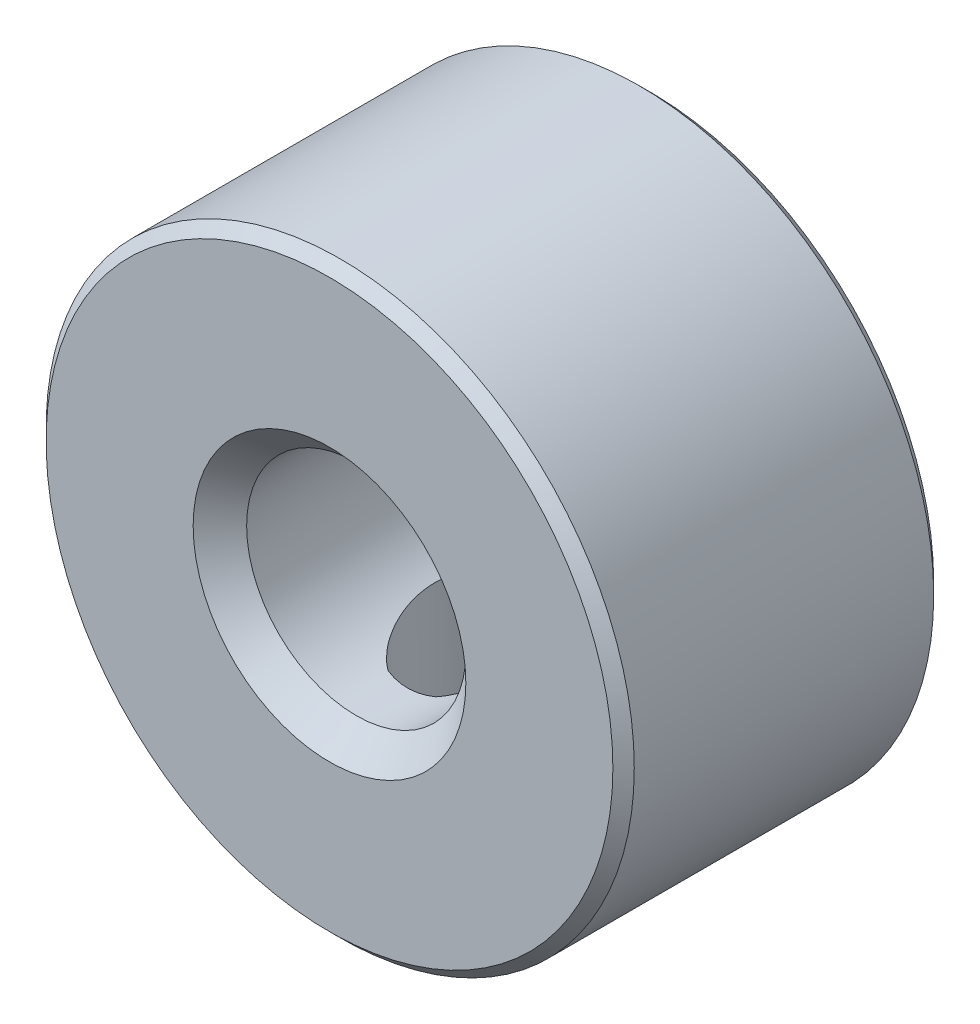
ISO-10303-21;
HEADER;
FILE_DESCRIPTION(('STEP AP214'),'2;1');
FILE_NAME('part.step','',(''),(''),'','','');
FILE_SCHEMA(('AUTOMOTIVE_DESIGN { 1 0 10303 214 1 1 1 1 }'));
ENDSEC;
DATA;
#1=APPLICATION_CONTEXT('core data for automotive mechanical design processes');
#2=APPLICATION_PROTOCOL_DEFINITION('international standard','automotive_design',2000,#1);
#3=PRODUCT_CONTEXT('',#1,'mechanical');
#4=PRODUCT('Part','Part','',(#3));
#5=PRODUCT_RELATED_PRODUCT_CATEGORY('part','',(#4));
#6=PRODUCT_DEFINITION_FORMATION('','',#4);
#7=PRODUCT_DEFINITION_CONTEXT('part definition',#1,'design');
#8=PRODUCT_DEFINITION('design','',#6,#7);
#9=PRODUCT_DEFINITION_SHAPE('','',#8);
#10=(LENGTH_UNIT() NAMED_UNIT(*) SI_UNIT(.MILLI.,.METRE.));
#11=(NAMED_UNIT(*) PLANE_ANGLE_UNIT() SI_UNIT($,.RADIAN.));
#12=(NAMED_UNIT(*) SI_UNIT($,.STERADIAN.) SOLID_ANGLE_UNIT());
#13=UNCERTAINTY_MEASURE_WITH_UNIT(LENGTH_MEASURE(1.E-05),#10,'distance_accuracy_value','');
#14=(GEOMETRIC_REPRESENTATION_CONTEXT(3) GLOBAL_UNCERTAINTY_ASSIGNED_CONTEXT((#13)) GLOBAL_UNIT_ASSIGNED_CONTEXT((#10,
#11,#12)) REPRESENTATION_CONTEXT('',''));
#15=CARTESIAN_POINT('',(0.,0.,0.));
#16=DIRECTION('',(0.,0.,1.));
#17=DIRECTION('',(1.,0.,0.));
#18=AXIS2_PLACEMENT_3D('',#15,#16,#17);
#19=CARTESIAN_POINT('',(0.,0.,6.));
#20=DIRECTION('',(0.,0.,1.));
#21=DIRECTION('',(1.,0.,0.));
#22=AXIS2_PLACEMENT_3D('',#19,#20,#21);
#23=PLANE('',#22);
#24=CARTESIAN_POINT('',(0.,0.,6.));
#25=DIRECTION('',(0.,0.,1.));
#26=DIRECTION('',(1.,0.,0.));
#27=AXIS2_PLACEMENT_3D('',#24,#25,#26);
#28=CIRCLE('',#27,5.3);
#29=CARTESIAN_POINT('',(5.3,0.,6.));
#30=VERTEX_POINT('',#29);
#31=EDGE_CURVE('E11',#30,#30,#28,.T.);
#32=ORIENTED_EDGE('',*,*,#31,.T.);
#33=EDGE_LOOP('',(#32));
#34=FACE_BOUND('',#33,.T.);
#35=CARTESIAN_POINT('',(0.,0.,6.));
#36=DIRECTION('',(0.,0.,1.));
#37=DIRECTION('',(1.,0.,0.));
#38=AXIS2_PLACEMENT_3D('',#35,#36,#37);
#39=CIRCLE('',#38,2.55);
#40=CARTESIAN_POINT('',(2.55,0.,6.));
#41=VERTEX_POINT('',#40);
#42=EDGE_CURVE('E91',#41,#41,#39,.F.);
#43=ORIENTED_EDGE('',*,*,#42,.T.);
#44=EDGE_LOOP('',(#43));
#45=FACE_BOUND('',#44,.T.);
#46=ADVANCED_FACE('F35',(#34,#45),#23,.T.);
#47=CARTESIAN_POINT('',(0.,0.,0.));
#48=DIRECTION('',(0.,0.,1.));
#49=DIRECTION('',(1.,0.,0.));
#50=AXIS2_PLACEMENT_3D('',#47,#48,#49);
#51=PLANE('',#50);
#52=CARTESIAN_POINT('',(0.,0.,0.));
#53=DIRECTION('',(0.,0.,1.));
#54=DIRECTION('',(1.,0.,0.));
#55=AXIS2_PLACEMENT_3D('',#52,#53,#54);
#56=CIRCLE('',#55,5.3);
#57=CARTESIAN_POINT('',(5.3,0.,0.));
#58=VERTEX_POINT('',#57);
#59=EDGE_CURVE('E43',#58,#58,#56,.F.);
#60=ORIENTED_EDGE('',*,*,#59,.T.);
#61=EDGE_LOOP('',(#60));
#62=FACE_BOUND('',#61,.T.);
#63=CARTESIAN_POINT('',(0.,0.,0.));
#64=DIRECTION('',(0.,0.,1.));
#65=DIRECTION('',(1.,0.,0.));
#66=AXIS2_PLACEMENT_3D('',#63,#64,#65);
#67=CIRCLE('',#66,2.55);
#68=CARTESIAN_POINT('',(2.55,0.,0.));
#69=VERTEX_POINT('',#68);
#70=EDGE_CURVE('E89',#69,#69,#67,.T.);
#71=ORIENTED_EDGE('',*,*,#70,.T.);
#72=EDGE_LOOP('',(#71));
#73=FACE_BOUND('',#72,.T.);
#74=ADVANCED_FACE('F134',(#62,#73),#51,.F.);
#75=CARTESIAN_POINT('',(0.,0.,6.));
#76=DIRECTION('',(0.,0.,-1.));
#77=DIRECTION('',(-1.,0.,0.));
#78=AXIS2_PLACEMENT_3D('',#75,#76,#77);
#79=CYLINDRICAL_SURFACE('',#78,5.5);
#80=CARTESIAN_POINT('',(0.,0.,0.2));
#81=DIRECTION('',(0.,0.,1.));
#82=DIRECTION('',(1.,0.,0.));
#83=AXIS2_PLACEMENT_3D('',#80,#81,#82);
#84=CIRCLE('',#83,5.5);
#85=CARTESIAN_POINT('',(5.5,0.,0.2));
#86=VERTEX_POINT('',#85);
#87=EDGE_CURVE('E81',#86,#86,#84,.T.);
#88=ORIENTED_EDGE('',*,*,#87,.T.);
#89=EDGE_LOOP('',(#88));
#90=FACE_BOUND('',#89,.T.);
#91=CARTESIAN_POINT('',(0.,0.,5.8));
#92=DIRECTION('',(0.,0.,1.));
#93=DIRECTION('',(1.,0.,0.));
#94=AXIS2_PLACEMENT_3D('',#91,#92,#93);
#95=CIRCLE('',#94,5.5);
#96=CARTESIAN_POINT('',(5.5,0.,5.8));
#97=VERTEX_POINT('',#96);
#98=EDGE_CURVE('E77',#97,#97,#95,.F.);
#99=ORIENTED_EDGE('',*,*,#98,.T.);
#100=EDGE_LOOP('',(#99));
#101=FACE_BOUND('',#100,.T.);
#102=CARTESIAN_POINT('',(1.79882381127734,-5.19752180331951,2.92468532461506));
#103=CARTESIAN_POINT('',(1.79882271235277,-5.19752277022742,2.83427132187842));
#104=CARTESIAN_POINT('',(1.79143734884807,-5.2000959961332,2.74384617805664));
#105=CARTESIAN_POINT('',(1.7621612728264,-5.21008828808521,2.56563955006393));
#106=CARTESIAN_POINT('',(1.74026571366199,-5.21750897325188,2.47785895946345));
#107=CARTESIAN_POINT('',(1.68276291224156,-5.23633601578697,2.30754712351616));
#108=CARTESIAN_POINT('',(1.64717847538319,-5.24773574124249,2.22500741201867));
#109=CARTESIAN_POINT('',(1.56335835837587,-5.27331236426124,2.06710119722023));
#110=CARTESIAN_POINT('',(1.51512078431858,-5.28748967749043,1.99173577006218));
#111=CARTESIAN_POINT('',(1.40569908389842,-5.31764178879598,1.84793229497995));
#112=CARTESIAN_POINT('',(1.34418339906073,-5.33365647041212,1.77975483687415));
#113=CARTESIAN_POINT('',(1.21062243044805,-5.36554757345354,1.65458357816031));
#114=CARTESIAN_POINT('',(1.13857579525281,-5.3814239768563,1.5975912151202));
#115=CARTESIAN_POINT('',(0.984121688993325,-5.41182194699678,1.49527635479843));
#116=CARTESIAN_POINT('',(0.901530770691854,-5.42630870684671,1.45021955772798));
#117=CARTESIAN_POINT('',(0.729430703486551,-5.45210867240958,1.37479933966804));
#118=CARTESIAN_POINT('',(0.639923051465754,-5.4634225623385,1.34443274977187));
#119=CARTESIAN_POINT('',(0.459228283708332,-5.48152482914642,1.30011732341551));
#120=CARTESIAN_POINT('',(0.368162457697901,-5.48843340613367,1.2857236841971));
#121=CARTESIAN_POINT('',(0.184684470334142,-5.49766509502398,1.27235626750398));
#122=CARTESIAN_POINT('',(0.0922725958368429,-5.49998916993278,1.27337925127291));
#123=CARTESIAN_POINT('',(-0.0881517568673919,-5.50001042060299,1.29051748001239));
#124=CARTESIAN_POINT('',(-0.176210614995318,-5.49785259396062,1.30615103780592));
#125=CARTESIAN_POINT('',(-0.348503222668076,-5.48962552387982,1.35127979420879));
#126=CARTESIAN_POINT('',(-0.432736729604845,-5.48355603272904,1.38077587065201));
#127=CARTESIAN_POINT('',(-0.596117510151969,-5.46822281858295,1.45311855037548));
#128=CARTESIAN_POINT('',(-0.675194116972168,-5.45892271530641,1.49611664770306));
#129=CARTESIAN_POINT('',(-0.825223139836848,-5.43826720046741,1.59412296228612));
#130=CARTESIAN_POINT('',(-0.89617362236455,-5.42691130140411,1.6491340288749));
#131=CARTESIAN_POINT('',(-1.03079711236392,-5.40299132455453,1.77210285044182));
#132=CARTESIAN_POINT('',(-1.09408415197144,-5.39039754799095,1.84047793554778));
#133=CARTESIAN_POINT('',(-1.2083827585079,-5.36593296611253,1.98694634429412));
#134=CARTESIAN_POINT('',(-1.25939310552682,-5.3540622327325,2.06504063254322));
#135=CARTESIAN_POINT('',(-1.34806378510265,-5.33243246538487,2.22974874078895));
#136=CARTESIAN_POINT('',(-1.3855914116283,-5.32269477239529,2.31643707506428));
#137=CARTESIAN_POINT('',(-1.44529677049916,-5.30679590798137,2.49525325390516));
#138=CARTESIAN_POINT('',(-1.46747951037898,-5.30063356990863,2.58737931330308));
#139=CARTESIAN_POINT('',(-1.49511833579267,-5.29290286465048,2.77077592142827));
#140=CARTESIAN_POINT('',(-1.50116705127659,-5.29117182886291,2.86195037089844));
#141=CARTESIAN_POINT('',(-1.49801633595007,-5.2920648693097,3.04400551462592));
#142=CARTESIAN_POINT('',(-1.48881903959472,-5.29468833590997,3.134886248219));
#143=CARTESIAN_POINT('',(-1.45597254171014,-5.30381170817305,3.31132254038302));
#144=CARTESIAN_POINT('',(-1.43270498868998,-5.31020913853422,3.39695510530494));
#145=CARTESIAN_POINT('',(-1.3728375493171,-5.32599935299877,3.56312718451147));
#146=CARTESIAN_POINT('',(-1.33623560443951,-5.3353925995597,3.64366591016969));
#147=CARTESIAN_POINT('',(-1.24963911602642,-5.35634500100131,3.7997545350944));
#148=CARTESIAN_POINT('',(-1.19931148557414,-5.36795552167757,3.87511251769943));
#149=CARTESIAN_POINT('',(-1.08712079130147,-5.39179482119942,4.01658724141394));
#150=CARTESIAN_POINT('',(-1.02525496647219,-5.40402374751358,4.08270176398913));
#151=CARTESIAN_POINT('',(-0.888997259896711,-5.42813413013973,4.20638377101127));
#152=CARTESIAN_POINT('',(-0.814220757058255,-5.43998505458786,4.26353451650074));
#153=CARTESIAN_POINT('',(-0.655863832530002,-5.46133831927496,4.36454869574559));
#154=CARTESIAN_POINT('',(-0.572283848337845,-5.47084077614485,4.40841278937467));
#155=CARTESIAN_POINT('',(-0.399273224831795,-5.48616964711369,4.48118535824018));
#156=CARTESIAN_POINT('',(-0.309892167203815,-5.49202359358081,4.51020554238993));
#157=CARTESIAN_POINT('',(-0.127347086376123,-5.49928305500692,4.55275233539452));
#158=CARTESIAN_POINT('',(-0.0341841534362642,-5.50068984292183,4.56628337715832));
#159=CARTESIAN_POINT('',(0.149418467195574,-5.49870712397061,4.57713067307501));
#160=CARTESIAN_POINT('',(0.239824865243099,-5.4955002354024,4.57505128956367));
#161=CARTESIAN_POINT('',(0.418819343336131,-5.48476332276289,4.55618152886602));
#162=CARTESIAN_POINT('',(0.507407526188003,-5.47723354381981,4.53939198578657));
#163=CARTESIAN_POINT('',(0.679336544005973,-5.45856268714421,4.49195249707547));
#164=CARTESIAN_POINT('',(0.762723511668369,-5.44746125722705,4.46145332590114));
#165=CARTESIAN_POINT('',(0.923157458067542,-5.42258038757218,4.38759521865715));
#166=CARTESIAN_POINT('',(1.00020339227316,-5.40880050787674,4.34423416930025));
#167=CARTESIAN_POINT('',(1.14847138497107,-5.37930417707724,4.24427452144202));
#168=CARTESIAN_POINT('',(1.21942821373193,-5.3635398691611,4.18729675161421));
#169=CARTESIAN_POINT('',(1.35096302625149,-5.33193061505926,4.06240389744898));
#170=CARTESIAN_POINT('',(1.41153801027421,-5.31608564692474,3.99448566292709));
#171=CARTESIAN_POINT('',(1.5224348937538,-5.28541454286004,3.8472104684735));
#172=CARTESIAN_POINT('',(1.57239739685079,-5.27063284779447,3.76757291588558));
#173=CARTESIAN_POINT('',(1.65824586251902,-5.24425869429985,3.60057463303794));
#174=CARTESIAN_POINT('',(1.69413858902682,-5.2326647042087,3.51321763865374));
#175=CARTESIAN_POINT('',(1.74762320113215,-5.21502815090572,3.34297084984816));
#176=CARTESIAN_POINT('',(1.76677166595779,-5.20852162956091,3.26061581299097));
#177=CARTESIAN_POINT('',(1.79237121200386,-5.19976843075794,3.09373857986971));
#178=CARTESIAN_POINT('',(1.79882483870381,-5.19752089932045,3.00921682150529));
#179=CARTESIAN_POINT('',(1.79882381127734,-5.19752180331951,2.92468532461506));
#180=B_SPLINE_CURVE_WITH_KNOTS('',3,(#102,#103,#104,#105,#106,#107,#108,#109,#110,#111,#112,
#113,#114,#115,#116,#117,#118,#119,#120,#121,#122,#123,#124,#125,#126,#127,#128,#129,#130,#131,
#132,#133,#134,#135,#136,#137,#138,#139,#140,#141,#142,#143,#144,#145,#146,#147,#148,#149,#150,
#151,#152,#153,#154,#155,#156,#157,#158,#159,#160,#161,#162,#163,#164,#165,#166,#167,#168,#169,
#170,#171,#172,#173,#174,#175,#176,#177,#178,#179),.UNSPECIFIED.,.T.,.F.,(4,2,2,2,2,2,2,2,2,2,2,
2,2,2,2,2,2,2,2,2,2,2,2,2,2,2,2,2,2,2,2,2,2,2,2,2,2,2,4),(0.,0.270930182507096,
0.541950905857899,0.812522055912811,1.08313372790711,1.36150465008782,1.639911326584,
1.92407533201008,2.20817801146664,2.48415354164513,2.76007109511583,3.02720138589967,
3.29434859479413,3.56460730269243,3.83493018249912,4.11567361725604,4.39644493741048,
4.67990862070891,4.96327975691251,5.23608888869338,5.50885983018124,5.77454454432696,
6.04027029150364,6.31312804990325,6.58605118521813,6.8692745671066,7.1524838805662,
7.43352930995755,7.71449428553848,7.98463934302339,8.25476908352527,8.52199806559438,
8.78927097940513,9.06509589759934,9.34100037892876,9.62512803636058,9.90911893360335,
10.1624726924319,10.4157756453691),.UNSPECIFIED.);
#181=CARTESIAN_POINT('',(1.79882381127734,-5.19752180331951,2.92468532461506));
#182=VERTEX_POINT('',#181);
#183=EDGE_CURVE('E103',#182,#182,#180,.T.);
#184=ORIENTED_EDGE('',*,*,#183,.T.);
#185=EDGE_LOOP('',(#184));
#186=FACE_BOUND('',#185,.T.);
#187=ADVANCED_FACE('F109',(#90,#101,#186),#79,.T.);
#188=CARTESIAN_POINT('',(0.,0.,6.));
#189=DIRECTION('',(0.,0.,-1.));
#190=DIRECTION('',(-1.,0.,0.));
#191=AXIS2_PLACEMENT_3D('',#188,#189,#190);
#192=CYLINDRICAL_SURFACE('',#191,2.05);
#193=CARTESIAN_POINT('',(-0.597135601115898,-1.96110404463404,1.51264495381025));
#194=CARTESIAN_POINT('',(-0.660692302002261,-1.94175742137929,1.58053297599537));
#195=CARTESIAN_POINT('',(-0.717231308370007,-1.92120532770499,1.65476490792224));
#196=CARTESIAN_POINT('',(-0.818040066383286,-1.88049715566651,1.81145886164296));
#197=CARTESIAN_POINT('',(-0.862245614849223,-1.86034363905839,1.89396101883501));
#198=CARTESIAN_POINT('',(-0.940713856679954,-1.82195715536743,2.06788233784289));
#199=CARTESIAN_POINT('',(-0.974540981223558,-1.80382469156875,2.1595199812671));
#200=CARTESIAN_POINT('',(-1.03024462144553,-1.77260294847062,2.34703294117965));
#201=CARTESIAN_POINT('',(-1.05214158217556,-1.75950505271267,2.44290070158645));
#202=CARTESIAN_POINT('',(-1.07768139910767,-1.74391012961538,2.59918254134527));
#203=CARTESIAN_POINT('',(-1.08511432367632,-1.73927047408078,2.65879059247182));
#204=CARTESIAN_POINT('',(-1.09546808916292,-1.73276932161891,2.77856526175753));
#205=CARTESIAN_POINT('',(-1.09838846933627,-1.73090810837977,2.838731936323));
#206=CARTESIAN_POINT('',(-1.09968369032503,-1.73008579243971,2.95917213235719));
#207=CARTESIAN_POINT('',(-1.09805574132166,-1.73112646967705,3.01944569673104));
#208=CARTESIAN_POINT('',(-1.09026903944744,-1.73603874935022,3.13956607933882));
#209=CARTESIAN_POINT('',(-1.08411051742439,-1.73991020754828,3.19941291915891));
#210=CARTESIAN_POINT('',(-1.05972849030858,-1.75495165070321,3.37188470589074));
#211=CARTESIAN_POINT('',(-1.03563320836035,-1.76955499388187,3.48343770341964));
#212=CARTESIAN_POINT('',(-0.971516545963288,-1.80554638231856,3.70076784065071));
#213=CARTESIAN_POINT('',(-0.931484232402029,-1.82693908316004,3.80654095847467));
#214=CARTESIAN_POINT('',(-0.845551677040129,-1.8679608091031,3.98696857952869));
#215=CARTESIAN_POINT('',(-0.802908807673673,-1.88693302129295,4.06333068330253));
#216=CARTESIAN_POINT('',(-0.706582703051676,-1.92507895922947,4.20867415050588));
#217=CARTESIAN_POINT('',(-0.652926949516687,-1.94425207275309,4.27767324851659));
#218=CARTESIAN_POINT('',(-0.555398509345729,-1.97371952278747,4.38093736129838));
#219=CARTESIAN_POINT('',(-0.515306452151599,-1.9846644354478,4.41857792926086));
#220=CARTESIAN_POINT('',(-0.429840870841329,-2.00490904411783,4.48788081174161));
#221=CARTESIAN_POINT('',(-0.384474859676382,-2.01421103404616,4.51955146593316));
#222=CARTESIAN_POINT('',(-0.298927333255808,-2.02844568854438,4.56876174624258));
#223=CARTESIAN_POINT('',(-0.259746065466742,-2.03388821838338,4.58787615559664));
#224=CARTESIAN_POINT('',(-0.178653448164691,-2.04260609383126,4.6198097248072));
#225=CARTESIAN_POINT('',(-0.136744908359758,-2.04588363222784,4.63263525088555));
#226=CARTESIAN_POINT('',(-0.0508209942517268,-2.0498237646916,4.65091151039979));
#227=CARTESIAN_POINT('',(-0.00679099978137,-2.05046439009747,4.65630003911961));
#228=CARTESIAN_POINT('',(0.0814539144354859,-2.04885573049431,4.65888109005367));
#229=CARTESIAN_POINT('',(0.125668767128657,-2.04660741571733,4.65607636351741));
#230=CARTESIAN_POINT('',(0.207201062417204,-2.03986112392422,4.64345629778972));
#231=CARTESIAN_POINT('',(0.244692850025034,-2.03567742274245,4.6345554521245));
#232=CARTESIAN_POINT('',(0.317737308745591,-2.02556282111701,4.61144317110508));
#233=CARTESIAN_POINT('',(0.353289072371257,-2.01963111116932,4.59722927445299));
#234=CARTESIAN_POINT('',(0.437344439978622,-2.00344529717077,4.55699634671091));
#235=CARTESIAN_POINT('',(0.484534126996111,-1.99244428299475,4.52854047672981));
#236=CARTESIAN_POINT('',(0.573509220757855,-1.96868489009019,4.46475354779995));
#237=CARTESIAN_POINT('',(0.615280951237231,-1.95592222576735,4.42940563320705));
#238=CARTESIAN_POINT('',(0.714714546019425,-1.92242971840373,4.33335305416851));
#239=CARTESIAN_POINT('',(0.768854635024518,-1.90110366142074,4.26922902139991));
#240=CARTESIAN_POINT('',(0.866441820951563,-1.85865769752097,4.13326406087222));
#241=CARTESIAN_POINT('',(0.909861555271377,-1.83753844760438,4.06140404490553));
#242=CARTESIAN_POINT('',(1.00186029436418,-1.78952625122288,3.88385007356204));
#243=CARTESIAN_POINT('',(1.04612347238789,-1.76349133421315,3.77568069108465));
#244=CARTESIAN_POINT('',(1.11778455660818,-1.71896498823691,3.55248861787235));
#245=CARTESIAN_POINT('',(1.14519156833115,-1.70046948837952,3.43746966410258));
#246=CARTESIAN_POINT('',(1.1736815680563,-1.68080068162166,3.26188808183416));
#247=CARTESIAN_POINT('',(1.18107681978009,-1.67558793876842,3.20273454300372));
#248=CARTESIAN_POINT('',(1.19158139435912,-1.66813648171017,3.08384727744366));
#249=CARTESIAN_POINT('',(1.19469071908995,-1.66589776620369,3.02411355096795));
#250=CARTESIAN_POINT('',(1.19659531648899,-1.66453029877049,2.90456629899086));
#251=CARTESIAN_POINT('',(1.19539238893677,-1.66540024939746,2.84475281719362));
#252=CARTESIAN_POINT('',(1.18868992078886,-1.67018838568178,2.7255048390425));
#253=CARTESIAN_POINT('',(1.18319048190828,-1.67410649917727,2.66607033375037));
#254=CARTESIAN_POINT('',(1.16092663357676,-1.68970304570287,2.49384544092547));
#255=CARTESIAN_POINT('',(1.13845721595503,-1.70520272387137,2.38207953864069));
#256=CARTESIAN_POINT('',(1.07800505306871,-1.74404284390429,2.16416643186963));
#257=CARTESIAN_POINT('',(1.04000611173616,-1.7673914670742,2.0580252244465));
#258=CARTESIAN_POINT('',(0.957410838922617,-1.81317400585708,1.87562704738609));
#259=CARTESIAN_POINT('',(0.915868880691723,-1.83477302810779,1.79777077172718));
#260=CARTESIAN_POINT('',(0.821512219305459,-1.87891878319264,1.64953528643754));
#261=CARTESIAN_POINT('',(0.768726625760163,-1.90146295025895,1.57913745861685));
#262=CARTESIAN_POINT('',(0.672648910082927,-1.93689844606476,1.47414638153992));
#263=CARTESIAN_POINT('',(0.633316985653214,-1.9502157637137,1.43608145651848));
#264=CARTESIAN_POINT('',(0.549248164015813,-1.97553762596769,1.36589779076063));
#265=CARTESIAN_POINT('',(0.504518858830795,-1.98754397031805,1.33377085507172));
#266=CARTESIAN_POINT('',(0.419889081514586,-2.00689984569243,1.28370152354663));
#267=CARTESIAN_POINT('',(0.381026195727274,-2.01469530790828,1.26419432000452));
#268=CARTESIAN_POINT('',(0.300385490101875,-2.02828355984499,1.23148253688434));
#269=CARTESIAN_POINT('',(0.258610570576382,-2.03407830891934,1.21827178616397));
#270=CARTESIAN_POINT('',(0.172716057943991,-2.04317044401843,1.19926089724881));
#271=CARTESIAN_POINT('',(0.128579316175443,-2.04644580558198,1.19352581606219));
#272=CARTESIAN_POINT('',(0.039896961450251,-2.05009123774967,1.19034447554126));
#273=CARTESIAN_POINT('',(-0.00464842875154784,-2.05046280677559,1.19289394023455));
#274=CARTESIAN_POINT('',(-0.0867761168834158,-2.04852138910471,1.2051128372702));
#275=CARTESIAN_POINT('',(-0.124516335724404,-2.04654797594834,1.21382302306135));
#276=CARTESIAN_POINT('',(-0.198199497566268,-2.04073161994608,1.2365935894318));
#277=CARTESIAN_POINT('',(-0.234140739618177,-2.03688694330084,1.25065892913532));
#278=CARTESIAN_POINT('',(-0.318988339510138,-2.0256598543791,1.29044925659265));
#279=CARTESIAN_POINT('',(-0.366651906725562,-2.01746525842737,1.31858185022641));
#280=CARTESIAN_POINT('',(-0.456669055105666,-1.99901860272343,1.38167718903999));
#281=CARTESIAN_POINT('',(-0.49901937793152,-1.98876529039093,1.41664409205787));
#282=CARTESIAN_POINT('',(-0.558885528601849,-1.97245441716405,1.47300137419265));
#283=CARTESIAN_POINT('',(-0.578318148637747,-1.96683206636317,1.49254511203922));
#284=CARTESIAN_POINT('',(-0.597135601115898,-1.96110404463404,1.51264495381025));
#285=B_SPLINE_CURVE_WITH_KNOTS('',3,(#193,#194,#195,#196,#197,#198,#199,#200,#201,#202,#203,
#204,#205,#206,#207,#208,#209,#210,#211,#212,#213,#214,#215,#216,#217,#218,#219,#220,#221,#222,
#223,#224,#225,#226,#227,#228,#229,#230,#231,#232,#233,#234,#235,#236,#237,#238,#239,#240,#241,
#242,#243,#244,#245,#246,#247,#248,#249,#250,#251,#252,#253,#254,#255,#256,#257,#258,#259,#260,
#261,#262,#263,#264,#265,#266,#267,#268,#269,#270,#271,#272,#273,#274,#275,#276,#277,#278,#279,
#280,#281,#282,#283,#284),.UNSPECIFIED.,.T.,.F.,(4,2,2,2,2,2,2,2,2,2,2,2,2,2,2,2,2,2,2,2,2,2,2,
2,2,2,2,2,2,2,2,2,2,2,2,2,2,2,2,2,2,2,2,2,2,4),(0.,0.284900417358522,0.571257361882669,
0.868364519671685,1.16496090223328,1.34549765624689,1.52605284239888,1.70671880039674,
1.88737555349955,2.23093942356793,2.57473939237913,2.84248165114061,3.10956373220957,
3.27733708887203,3.44487430883079,3.57618281513524,3.70735812230869,3.83962409283752,
3.97184565429567,4.08763653623466,4.20348112550189,4.37110718354667,4.53914846111726,
4.7974806897919,5.05646562241505,5.41392564582642,5.77119240304759,5.95052141994742,
6.12985035837015,6.30910446003611,6.48835431819,6.8318925276748,7.17578993844414,
7.44757310497755,7.71866100037321,7.88721963650452,8.05554388084416,8.18758307254098,
8.31949258537749,8.45254254132254,8.5855238359835,8.70137884089126,8.81734139496271,
8.98426039926135,9.15128127115858,9.23563272411135),.UNSPECIFIED.);
#286=CARTESIAN_POINT('',(0.506803480336857,-1.98636608718495,4.51213611125382));
#287=VERTEX_POINT('',#286);
#288=CARTESIAN_POINT('',(0.506803480336857,-1.98636608718495,1.33723453797631));
#289=VERTEX_POINT('',#288);
#290=EDGE_CURVE('E56',#287,#289,#285,.T.);
#291=ORIENTED_EDGE('',*,*,#290,.F.);
#292=CARTESIAN_POINT('',(-0.392831110137692,-2.01200987047976,4.51213611125381));
#293=CARTESIAN_POINT('',(-0.357155768306436,-2.01897616016912,4.52218853351672));
#294=CARTESIAN_POINT('',(-0.321000630739408,-2.02504753279233,4.53109884691943));
#295=CARTESIAN_POINT('',(-0.247908329754021,-2.03529021137271,4.54652803632219));
#296=CARTESIAN_POINT('',(-0.210970919644999,-2.03946090832385,4.55304614569285));
#297=CARTESIAN_POINT('',(-0.101532697644073,-2.04875979681479,4.56852494035443));
#298=CARTESIAN_POINT('',(-0.0282289209365724,-2.0511050941335,4.57402550775791));
#299=CARTESIAN_POINT('',(0.0837230318573252,-2.04866047664759,4.57495087003958));
#300=CARTESIAN_POINT('',(0.122471138069643,-2.04670537260932,4.57389554326738));
#301=CARTESIAN_POINT('',(0.199650879733653,-2.04062106446965,4.56906845436714));
#302=CARTESIAN_POINT('',(0.238082412790582,-2.03649118297938,4.56529584573891));
#303=CARTESIAN_POINT('',(0.3155120198952,-2.0259630846436,4.55492976544908));
#304=CARTESIAN_POINT('',(0.35448913023802,-2.01949678708322,4.54825024584712));
#305=CARTESIAN_POINT('',(0.431454310053384,-2.00446803665529,4.53218840222522));
#306=CARTESIAN_POINT('',(0.469442781603417,-1.99590645115607,4.52280719631582));
#307=CARTESIAN_POINT('',(0.506803480336857,-1.98636608718495,4.51213611125381));
#308=B_SPLINE_CURVE_WITH_KNOTS('',3,(#292,#293,#294,#295,#296,#297,#298,#299,#300,#301,#302,
#303,#304,#305,#306,#307),.UNSPECIFIED.,.F.,.F.,(4,2,2,2,2,2,2,4),(0.,0.113073248769661,
0.226182702535913,0.44557742709415,0.561886119296629,0.678231060199783,0.798282961327911,
0.918285249416078),.UNSPECIFIED.);
#309=CARTESIAN_POINT('',(-0.392831110137692,-2.01200987047976,4.51213611125382));
#310=VERTEX_POINT('',#309);
#311=EDGE_CURVE('E64',#310,#287,#308,.T.);
#312=ORIENTED_EDGE('',*,*,#311,.F.);
#313=CARTESIAN_POINT('',(-0.392831110137692,-2.01200987047976,1.33723453797631));
#314=VERTEX_POINT('',#313);
#315=EDGE_CURVE('E79',#314,#310,#285,.T.);
#316=ORIENTED_EDGE('',*,*,#315,.F.);
#317=CARTESIAN_POINT('',(0.506803480336857,-1.98636608718495,1.33723453797631));
#318=CARTESIAN_POINT('',(0.471582886103977,-1.99535324183455,1.3271821157134));
#319=CARTESIAN_POINT('',(0.435832297981839,-2.00347426313374,1.3182718023107));
#320=CARTESIAN_POINT('',(0.363442132082596,-2.01786387080453,1.30284261290794));
#321=CARTESIAN_POINT('',(0.326802273324543,-2.02413186321122,1.29632450353728));
#322=CARTESIAN_POINT('',(0.218071440581082,-2.03964958768372,1.28084570887569));
#323=CARTESIAN_POINT('',(0.145020283426815,-2.0461666834724,1.27534514147222));
#324=CARTESIAN_POINT('',(0.033110855570976,-2.0501031598153,1.27441977919055));
#325=CARTESIAN_POINT('',(-0.0056857035366555,-2.05035844054234,1.27547510596275));
#326=CARTESIAN_POINT('',(-0.0830867082153497,-2.04868040490791,1.28030219486299));
#327=CARTESIAN_POINT('',(-0.121691090144045,-2.04674640642471,1.28407480349122));
#328=CARTESIAN_POINT('',(-0.199594686388383,-2.04064602912962,1.29444088378105));
#329=CARTESIAN_POINT('',(-0.238876849123225,-2.03641048598982,1.30112040338301));
#330=CARTESIAN_POINT('',(-0.316573143036403,-2.02579030917428,1.31718224700491));
#331=CARTESIAN_POINT('',(-0.354987626231423,-2.01940656436206,1.32656345291431));
#332=CARTESIAN_POINT('',(-0.392831110137692,-2.01200987047976,1.33723453797631));
#333=B_SPLINE_CURVE_WITH_KNOTS('',3,(#317,#318,#319,#320,#321,#322,#323,#324,#325,#326,#327,
#328,#329,#330,#331,#332),.UNSPECIFIED.,.F.,.F.,(4,2,2,2,2,2,2,4),(0.,0.113073248769661,
0.226182702535913,0.44557742709415,0.561886119296629,0.678231060199783,0.798282961327911,
0.918285249416078),.UNSPECIFIED.);
#334=EDGE_CURVE('E71',#289,#314,#333,.T.);
#335=ORIENTED_EDGE('',*,*,#334,.F.);
#336=EDGE_LOOP('',(#291,#312,#316,#335));
#337=FACE_BOUND('',#336,.T.);
#338=CARTESIAN_POINT('',(0.,0.,5.50000000000001));
#339=DIRECTION('',(0.,0.,1.));
#340=DIRECTION('',(1.,0.,0.));
#341=AXIS2_PLACEMENT_3D('',#338,#339,#340);
#342=CIRCLE('',#341,2.05);
#343=CARTESIAN_POINT('',(2.05,0.,5.50000000000001));
#344=VERTEX_POINT('',#343);
#345=EDGE_CURVE('E95',#344,#344,#342,.T.);
#346=ORIENTED_EDGE('',*,*,#345,.T.);
#347=EDGE_LOOP('',(#346));
#348=FACE_BOUND('',#347,.T.);
#349=CARTESIAN_POINT('',(0.,0.,0.499999999999999));
#350=DIRECTION('',(0.,0.,1.));
#351=DIRECTION('',(1.,0.,0.));
#352=AXIS2_PLACEMENT_3D('',#349,#350,#351);
#353=CIRCLE('',#352,2.05);
#354=CARTESIAN_POINT('',(2.05,0.,0.499999999999999));
#355=VERTEX_POINT('',#354);
#356=EDGE_CURVE('E100',#355,#355,#353,.F.);
#357=ORIENTED_EDGE('',*,*,#356,.T.);
#358=EDGE_LOOP('',(#357));
#359=FACE_BOUND('',#358,.T.);
#360=ADVANCED_FACE('F75',(#337,#348,#359),#192,.F.);
#361=CARTESIAN_POINT('',(0.,0.,5.50000000000001));
#362=DIRECTION('',(0.,0.,1.));
#363=DIRECTION('',(1.,0.,0.));
#364=AXIS2_PLACEMENT_3D('',#361,#362,#363);
#365=CONICAL_SURFACE('',#364,2.05,0.78539816339745);
#366=ORIENTED_EDGE('',*,*,#42,.F.);
#367=EDGE_LOOP('',(#366));
#368=FACE_BOUND('',#367,.T.);
#369=ORIENTED_EDGE('',*,*,#345,.F.);
#370=EDGE_LOOP('',(#369));
#371=FACE_BOUND('',#370,.T.);
#372=ADVANCED_FACE('F130',(#368,#371),#365,.F.);
#373=CARTESIAN_POINT('',(0.,0.,0.));
#374=DIRECTION('',(0.,0.,-1.));
#375=DIRECTION('',(-1.,0.,0.));
#376=AXIS2_PLACEMENT_3D('',#373,#374,#375);
#377=CONICAL_SURFACE('',#376,2.55,0.785398163397447);
#378=ORIENTED_EDGE('',*,*,#356,.F.);
#379=EDGE_LOOP('',(#378));
#380=FACE_BOUND('',#379,.T.);
#381=ORIENTED_EDGE('',*,*,#70,.F.);
#382=EDGE_LOOP('',(#381));
#383=FACE_BOUND('',#382,.T.);
#384=ADVANCED_FACE('F115',(#380,#383),#377,.F.);
#385=CARTESIAN_POINT('',(0.15671200902385,-5.49776694178898,2.92468532461506));
#386=DIRECTION('',(0.0284930925497913,-0.999593989416177,0.));
#387=DIRECTION('',(0.999593989416178,0.0284930925497913,0.));
#388=AXIS2_PLACEMENT_3D('',#385,#386,#387);
#389=CYLINDRICAL_SURFACE('',#388,1.64999999999999);
#390=ORIENTED_EDGE('',*,*,#311,.T.);
#391=CARTESIAN_POINT('',(0.0569861850995808,-1.99918797883236,2.92468532461506));
#392=DIRECTION('',(0.0284930925497913,-0.999593989416177,0.));
#393=DIRECTION('',(0.999593989416178,0.0284930925497913,0.));
#394=AXIS2_PLACEMENT_3D('',#391,#392,#393);
#395=CIRCLE('',#394,1.65);
#396=EDGE_CURVE('E67',#289,#287,#395,.T.);
#397=ORIENTED_EDGE('',*,*,#396,.F.);
#398=ORIENTED_EDGE('',*,*,#334,.T.);
#399=EDGE_CURVE('E49',#310,#314,#395,.T.);
#400=ORIENTED_EDGE('',*,*,#399,.F.);
#401=EDGE_LOOP('',(#390,#397,#398,#400));
#402=FACE_BOUND('',#401,.T.);
#403=ORIENTED_EDGE('',*,*,#183,.F.);
#404=EDGE_LOOP('',(#403));
#405=FACE_BOUND('',#404,.T.);
#406=ADVANCED_FACE('F65',(#402,#405),#389,.F.);
#407=CARTESIAN_POINT('',(0.0569861850995808,-1.99918797883236,2.92468532461506));
#408=DIRECTION('',(0.0284930925497913,-0.999593989416177,0.));
#409=DIRECTION('',(0.999593989416178,0.0284930925497913,0.));
#410=AXIS2_PLACEMENT_3D('',#407,#408,#409);
#411=CONICAL_SURFACE('',#410,1.65,1.02974425867665);
#412=ORIENTED_EDGE('',*,*,#290,.T.);
#413=ORIENTED_EDGE('',*,*,#396,.T.);
#414=EDGE_LOOP('',(#412,#413));
#415=FACE_BOUND('',#414,.T.);
#416=ADVANCED_FACE('F73',(#415),#411,.F.);
#417=ORIENTED_EDGE('',*,*,#315,.T.);
#418=ORIENTED_EDGE('',*,*,#399,.T.);
#419=EDGE_LOOP('',(#417,#418));
#420=FACE_BOUND('',#419,.T.);
#421=ADVANCED_FACE('F116',(#420),#411,.F.);
#422=CARTESIAN_POINT('',(0.,0.,0.2));
#423=DIRECTION('',(0.,0.,1.));
#424=DIRECTION('',(1.,0.,0.));
#425=AXIS2_PLACEMENT_3D('',#422,#423,#424);
#426=CONICAL_SURFACE('',#425,5.5,0.785398163397453);
#427=ORIENTED_EDGE('',*,*,#59,.F.);
#428=EDGE_LOOP('',(#427));
#429=FACE_BOUND('',#428,.T.);
#430=ORIENTED_EDGE('',*,*,#87,.F.);
#431=EDGE_LOOP('',(#430));
#432=FACE_BOUND('',#431,.T.);
#433=ADVANCED_FACE('F149',(#429,#432),#426,.T.);
#434=CARTESIAN_POINT('',(0.,0.,6.));
#435=DIRECTION('',(0.,0.,-1.));
#436=DIRECTION('',(-1.,0.,0.));
#437=AXIS2_PLACEMENT_3D('',#434,#435,#436);
#438=CONICAL_SURFACE('',#437,5.3,0.785398163397442);
#439=ORIENTED_EDGE('',*,*,#98,.F.);
#440=EDGE_LOOP('',(#439));
#441=FACE_BOUND('',#440,.T.);
#442=ORIENTED_EDGE('',*,*,#31,.F.);
#443=EDGE_LOOP('',(#442));
#444=FACE_BOUND('',#443,.T.);
#445=ADVANCED_FACE('F37',(#441,#444),#438,.T.);
#446=CLOSED_SHELL('',(#46,#74,#187,#360,#372,#384,#406,#416,#421,#433,#445));
#447=MANIFOLD_SOLID_BREP('B2',#446);
#448=ADVANCED_BREP_SHAPE_REPRESENTATION('',(#18,#447),#14);
#449=SHAPE_DEFINITION_REPRESENTATION(#9,#448);
ENDSEC;
END-ISO-10303-21;
